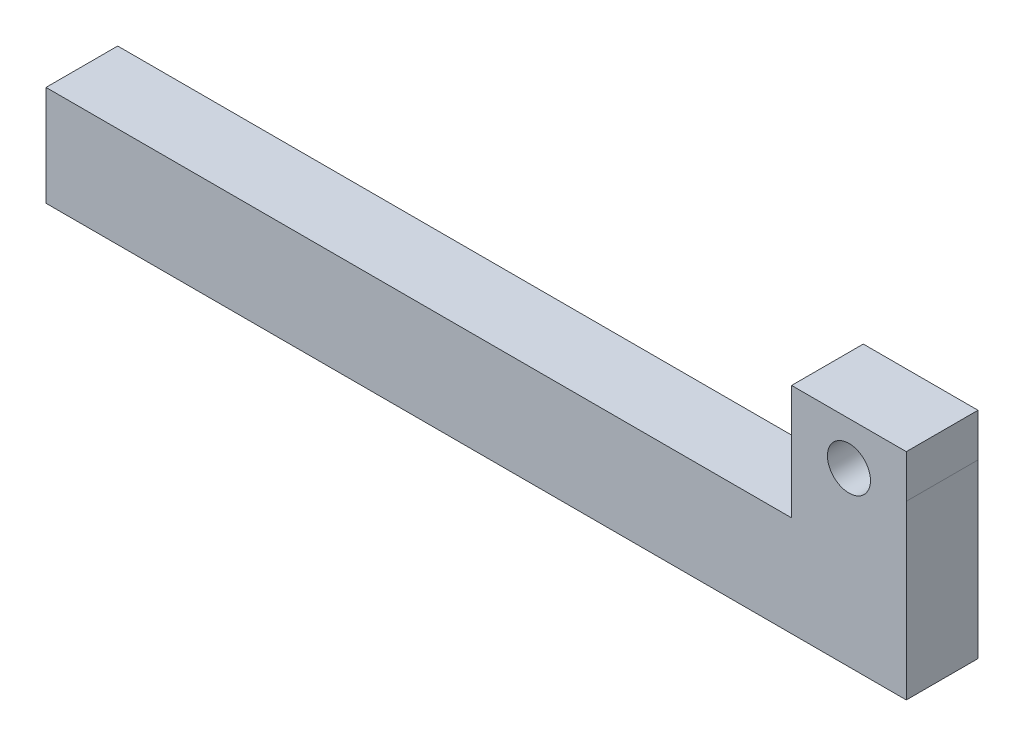
ISO-10303-21;
HEADER;
FILE_DESCRIPTION(('STEP AP214'),'2;1');
FILE_NAME('part.step','',(''),(''),'','','');
FILE_SCHEMA(('AUTOMOTIVE_DESIGN { 1 0 10303 214 1 1 1 1 }'));
ENDSEC;
DATA;
#1=APPLICATION_CONTEXT('core data for automotive mechanical design processes');
#2=APPLICATION_PROTOCOL_DEFINITION('international standard','automotive_design',2000,#1);
#3=PRODUCT_CONTEXT('',#1,'mechanical');
#4=PRODUCT('Part','Part','',(#3));
#5=PRODUCT_RELATED_PRODUCT_CATEGORY('part','',(#4));
#6=PRODUCT_DEFINITION_FORMATION('','',#4);
#7=PRODUCT_DEFINITION_CONTEXT('part definition',#1,'design');
#8=PRODUCT_DEFINITION('design','',#6,#7);
#9=PRODUCT_DEFINITION_SHAPE('','',#8);
#10=(LENGTH_UNIT() NAMED_UNIT(*) SI_UNIT(.MILLI.,.METRE.));
#11=(NAMED_UNIT(*) PLANE_ANGLE_UNIT() SI_UNIT($,.RADIAN.));
#12=(NAMED_UNIT(*) SI_UNIT($,.STERADIAN.) SOLID_ANGLE_UNIT());
#13=UNCERTAINTY_MEASURE_WITH_UNIT(LENGTH_MEASURE(1.E-05),#10,'distance_accuracy_value','');
#14=(GEOMETRIC_REPRESENTATION_CONTEXT(3) GLOBAL_UNCERTAINTY_ASSIGNED_CONTEXT((#13)) GLOBAL_UNIT_ASSIGNED_CONTEXT((#10,
#11,#12)) REPRESENTATION_CONTEXT('',''));
#15=CARTESIAN_POINT('',(0.,0.,0.));
#16=DIRECTION('',(0.,0.,1.));
#17=DIRECTION('',(1.,0.,0.));
#18=AXIS2_PLACEMENT_3D('',#15,#16,#17);
#19=CARTESIAN_POINT('',(300.,0.,25.));
#20=DIRECTION('',(-1.,0.,0.));
#21=DIRECTION('',(0.,0.,1.));
#22=AXIS2_PLACEMENT_3D('',#19,#20,#21);
#23=PLANE('',#22);
#24=DIRECTION('',(0.,0.,-1.));
#25=VECTOR('',#24,1.);
#26=CARTESIAN_POINT('',(300.,60.,25.));
#27=LINE('',#26,#25);
#28=CARTESIAN_POINT('',(300.,60.,25.));
#29=VERTEX_POINT('',#28);
#30=CARTESIAN_POINT('',(300.,60.,0.));
#31=VERTEX_POINT('',#30);
#32=EDGE_CURVE('E11',#29,#31,#27,.T.);
#33=ORIENTED_EDGE('',*,*,#32,.F.);
#34=DIRECTION('',(0.,1.,0.));
#35=VECTOR('',#34,1.);
#36=CARTESIAN_POINT('',(300.,0.,25.));
#37=LINE('',#36,#35);
#38=CARTESIAN_POINT('',(300.,0.,25.));
#39=VERTEX_POINT('',#38);
#40=EDGE_CURVE('E147',#39,#29,#37,.T.);
#41=ORIENTED_EDGE('',*,*,#40,.F.);
#42=DIRECTION('',(0.,0.,-1.));
#43=VECTOR('',#42,1.);
#44=CARTESIAN_POINT('',(300.,0.,25.));
#45=LINE('',#44,#43);
#46=CARTESIAN_POINT('',(300.,0.,0.));
#47=VERTEX_POINT('',#46);
#48=EDGE_CURVE('E99',#39,#47,#45,.T.);
#49=ORIENTED_EDGE('',*,*,#48,.T.);
#50=DIRECTION('',(0.,1.,0.));
#51=VECTOR('',#50,1.);
#52=CARTESIAN_POINT('',(300.,0.,0.));
#53=LINE('',#52,#51);
#54=EDGE_CURVE('E135',#47,#31,#53,.T.);
#55=ORIENTED_EDGE('',*,*,#54,.T.);
#56=EDGE_LOOP('',(#33,#41,#49,#55));
#57=FACE_BOUND('',#56,.T.);
#58=ADVANCED_FACE('F36',(#57),#23,.F.);
#59=CARTESIAN_POINT('',(0.,35.,25.));
#60=DIRECTION('',(0.,0.,1.));
#61=DIRECTION('',(1.,0.,0.));
#62=AXIS2_PLACEMENT_3D('',#59,#60,#61);
#63=PLANE('',#62);
#64=DIRECTION('',(0.,-1.,0.));
#65=VECTOR('',#64,1.);
#66=CARTESIAN_POINT('',(0.,0.,25.));
#67=LINE('',#66,#65);
#68=CARTESIAN_POINT('',(0.,35.,25.));
#69=VERTEX_POINT('',#68);
#70=CARTESIAN_POINT('',(0.,0.,25.));
#71=VERTEX_POINT('',#70);
#72=EDGE_CURVE('E103',#69,#71,#67,.T.);
#73=ORIENTED_EDGE('',*,*,#72,.T.);
#74=DIRECTION('',(1.,0.,0.));
#75=VECTOR('',#74,1.);
#76=CARTESIAN_POINT('',(0.,0.,25.));
#77=LINE('',#76,#75);
#78=EDGE_CURVE('E93',#71,#39,#77,.T.);
#79=ORIENTED_EDGE('',*,*,#78,.T.);
#80=ORIENTED_EDGE('',*,*,#40,.T.);
#81=CARTESIAN_POINT('',(300.,75.,25.));
#82=VERTEX_POINT('',#81);
#83=EDGE_CURVE('E102',#29,#82,#37,.T.);
#84=ORIENTED_EDGE('',*,*,#83,.T.);
#85=DIRECTION('',(-1.,0.,0.));
#86=VECTOR('',#85,1.);
#87=CARTESIAN_POINT('',(300.,75.,25.));
#88=LINE('',#87,#86);
#89=CARTESIAN_POINT('',(260.,75.,25.));
#90=VERTEX_POINT('',#89);
#91=EDGE_CURVE('E145',#82,#90,#88,.T.);
#92=ORIENTED_EDGE('',*,*,#91,.T.);
#93=DIRECTION('',(0.,-1.,0.));
#94=VECTOR('',#93,1.);
#95=CARTESIAN_POINT('',(260.,35.,25.));
#96=LINE('',#95,#94);
#97=CARTESIAN_POINT('',(260.,35.,25.));
#98=VERTEX_POINT('',#97);
#99=EDGE_CURVE('E143',#90,#98,#96,.T.);
#100=ORIENTED_EDGE('',*,*,#99,.T.);
#101=DIRECTION('',(-1.,0.,0.));
#102=VECTOR('',#101,1.);
#103=CARTESIAN_POINT('',(260.,35.,25.));
#104=LINE('',#103,#102);
#105=EDGE_CURVE('E109',#98,#69,#104,.T.);
#106=ORIENTED_EDGE('',*,*,#105,.T.);
#107=EDGE_LOOP('',(#73,#79,#80,#84,#92,#100,#106));
#108=FACE_BOUND('',#107,.T.);
#109=CARTESIAN_POINT('',(280.,60.,25.));
#110=DIRECTION('',(0.,0.,1.));
#111=DIRECTION('',(1.,0.,0.));
#112=AXIS2_PLACEMENT_3D('',#109,#110,#111);
#113=CIRCLE('',#112,7.50000000000001);
#114=CARTESIAN_POINT('',(287.5,60.,25.));
#115=VERTEX_POINT('',#114);
#116=EDGE_CURVE('E141',#115,#115,#113,.T.);
#117=ORIENTED_EDGE('',*,*,#116,.F.);
#118=EDGE_LOOP('',(#117));
#119=FACE_BOUND('',#118,.T.);
#120=ADVANCED_FACE('F106',(#108,#119),#63,.T.);
#121=CARTESIAN_POINT('',(0.,35.,0.));
#122=DIRECTION('',(0.,0.,1.));
#123=DIRECTION('',(1.,0.,0.));
#124=AXIS2_PLACEMENT_3D('',#121,#122,#123);
#125=PLANE('',#124);
#126=DIRECTION('',(0.,-1.,0.));
#127=VECTOR('',#126,1.);
#128=CARTESIAN_POINT('',(0.,0.,0.));
#129=LINE('',#128,#127);
#130=CARTESIAN_POINT('',(0.,35.,0.));
#131=VERTEX_POINT('',#130);
#132=CARTESIAN_POINT('',(0.,0.,0.));
#133=VERTEX_POINT('',#132);
#134=EDGE_CURVE('E116',#131,#133,#129,.T.);
#135=ORIENTED_EDGE('',*,*,#134,.F.);
#136=DIRECTION('',(-1.,0.,0.));
#137=VECTOR('',#136,1.);
#138=CARTESIAN_POINT('',(260.,35.,0.));
#139=LINE('',#138,#137);
#140=CARTESIAN_POINT('',(260.,35.,0.));
#141=VERTEX_POINT('',#140);
#142=EDGE_CURVE('E113',#141,#131,#139,.T.);
#143=ORIENTED_EDGE('',*,*,#142,.F.);
#144=DIRECTION('',(0.,-1.,0.));
#145=VECTOR('',#144,1.);
#146=CARTESIAN_POINT('',(260.,35.,0.));
#147=LINE('',#146,#145);
#148=CARTESIAN_POINT('',(260.,75.,0.));
#149=VERTEX_POINT('',#148);
#150=EDGE_CURVE('E131',#149,#141,#147,.T.);
#151=ORIENTED_EDGE('',*,*,#150,.F.);
#152=DIRECTION('',(-1.,0.,0.));
#153=VECTOR('',#152,1.);
#154=CARTESIAN_POINT('',(300.,75.,0.));
#155=LINE('',#154,#153);
#156=CARTESIAN_POINT('',(300.,75.,0.));
#157=VERTEX_POINT('',#156);
#158=EDGE_CURVE('E133',#157,#149,#155,.T.);
#159=ORIENTED_EDGE('',*,*,#158,.F.);
#160=EDGE_CURVE('E137',#31,#157,#53,.T.);
#161=ORIENTED_EDGE('',*,*,#160,.F.);
#162=ORIENTED_EDGE('',*,*,#54,.F.);
#163=DIRECTION('',(1.,0.,0.));
#164=VECTOR('',#163,1.);
#165=CARTESIAN_POINT('',(0.,0.,0.));
#166=LINE('',#165,#164);
#167=EDGE_CURVE('E138',#133,#47,#166,.T.);
#168=ORIENTED_EDGE('',*,*,#167,.F.);
#169=EDGE_LOOP('',(#135,#143,#151,#159,#161,#162,#168));
#170=FACE_BOUND('',#169,.T.);
#171=CARTESIAN_POINT('',(280.,60.,0.));
#172=DIRECTION('',(0.,0.,1.));
#173=DIRECTION('',(1.,0.,0.));
#174=AXIS2_PLACEMENT_3D('',#171,#172,#173);
#175=CIRCLE('',#174,7.50000000000001);
#176=CARTESIAN_POINT('',(287.5,60.,0.));
#177=VERTEX_POINT('',#176);
#178=EDGE_CURVE('E149',#177,#177,#175,.T.);
#179=ORIENTED_EDGE('',*,*,#178,.T.);
#180=EDGE_LOOP('',(#179));
#181=FACE_BOUND('',#180,.T.);
#182=ADVANCED_FACE('F158',(#170,#181),#125,.F.);
#183=CARTESIAN_POINT('',(0.,0.,25.));
#184=DIRECTION('',(1.,0.,0.));
#185=DIRECTION('',(0.,0.,-1.));
#186=AXIS2_PLACEMENT_3D('',#183,#184,#185);
#187=PLANE('',#186);
#188=ORIENTED_EDGE('',*,*,#134,.T.);
#189=DIRECTION('',(0.,0.,-1.));
#190=VECTOR('',#189,1.);
#191=CARTESIAN_POINT('',(0.,0.,25.));
#192=LINE('',#191,#190);
#193=EDGE_CURVE('E45',#71,#133,#192,.T.);
#194=ORIENTED_EDGE('',*,*,#193,.F.);
#195=ORIENTED_EDGE('',*,*,#72,.F.);
#196=DIRECTION('',(0.,0.,-1.));
#197=VECTOR('',#196,1.);
#198=CARTESIAN_POINT('',(0.,35.,25.));
#199=LINE('',#198,#197);
#200=EDGE_CURVE('E128',#69,#131,#199,.T.);
#201=ORIENTED_EDGE('',*,*,#200,.T.);
#202=EDGE_LOOP('',(#188,#194,#195,#201));
#203=FACE_BOUND('',#202,.T.);
#204=ADVANCED_FACE('F38',(#203),#187,.F.);
#205=CARTESIAN_POINT('',(0.,0.,25.));
#206=DIRECTION('',(0.,1.,0.));
#207=DIRECTION('',(0.,0.,1.));
#208=AXIS2_PLACEMENT_3D('',#205,#206,#207);
#209=PLANE('',#208);
#210=ORIENTED_EDGE('',*,*,#167,.T.);
#211=ORIENTED_EDGE('',*,*,#48,.F.);
#212=ORIENTED_EDGE('',*,*,#78,.F.);
#213=ORIENTED_EDGE('',*,*,#193,.T.);
#214=EDGE_LOOP('',(#210,#211,#212,#213));
#215=FACE_BOUND('',#214,.T.);
#216=ADVANCED_FACE('F95',(#215),#209,.F.);
#217=ORIENTED_EDGE('',*,*,#83,.F.);
#218=ORIENTED_EDGE('',*,*,#32,.T.);
#219=ORIENTED_EDGE('',*,*,#160,.T.);
#220=DIRECTION('',(0.,0.,-1.));
#221=VECTOR('',#220,1.);
#222=CARTESIAN_POINT('',(300.,75.,25.));
#223=LINE('',#222,#221);
#224=EDGE_CURVE('E117',#82,#157,#223,.T.);
#225=ORIENTED_EDGE('',*,*,#224,.F.);
#226=EDGE_LOOP('',(#217,#218,#219,#225));
#227=FACE_BOUND('',#226,.T.);
#228=ADVANCED_FACE('F167',(#227),#23,.F.);
#229=CARTESIAN_POINT('',(300.,75.,25.));
#230=DIRECTION('',(0.,-1.,0.));
#231=DIRECTION('',(0.,0.,-1.));
#232=AXIS2_PLACEMENT_3D('',#229,#230,#231);
#233=PLANE('',#232);
#234=ORIENTED_EDGE('',*,*,#158,.T.);
#235=DIRECTION('',(0.,0.,-1.));
#236=VECTOR('',#235,1.);
#237=CARTESIAN_POINT('',(260.,75.,25.));
#238=LINE('',#237,#236);
#239=EDGE_CURVE('E122',#90,#149,#238,.T.);
#240=ORIENTED_EDGE('',*,*,#239,.F.);
#241=ORIENTED_EDGE('',*,*,#91,.F.);
#242=ORIENTED_EDGE('',*,*,#224,.T.);
#243=EDGE_LOOP('',(#234,#240,#241,#242));
#244=FACE_BOUND('',#243,.T.);
#245=ADVANCED_FACE('F177',(#244),#233,.F.);
#246=CARTESIAN_POINT('',(260.,35.,25.));
#247=DIRECTION('',(1.,0.,0.));
#248=DIRECTION('',(0.,0.,-1.));
#249=AXIS2_PLACEMENT_3D('',#246,#247,#248);
#250=PLANE('',#249);
#251=ORIENTED_EDGE('',*,*,#150,.T.);
#252=DIRECTION('',(0.,0.,-1.));
#253=VECTOR('',#252,1.);
#254=CARTESIAN_POINT('',(260.,35.,25.));
#255=LINE('',#254,#253);
#256=EDGE_CURVE('E125',#98,#141,#255,.T.);
#257=ORIENTED_EDGE('',*,*,#256,.F.);
#258=ORIENTED_EDGE('',*,*,#99,.F.);
#259=ORIENTED_EDGE('',*,*,#239,.T.);
#260=EDGE_LOOP('',(#251,#257,#258,#259));
#261=FACE_BOUND('',#260,.T.);
#262=ADVANCED_FACE('F173',(#261),#250,.F.);
#263=CARTESIAN_POINT('',(260.,35.,25.));
#264=DIRECTION('',(0.,-1.,0.));
#265=DIRECTION('',(1.,0.,0.));
#266=AXIS2_PLACEMENT_3D('',#263,#264,#265);
#267=PLANE('',#266);
#268=ORIENTED_EDGE('',*,*,#142,.T.);
#269=ORIENTED_EDGE('',*,*,#200,.F.);
#270=ORIENTED_EDGE('',*,*,#105,.F.);
#271=ORIENTED_EDGE('',*,*,#256,.T.);
#272=EDGE_LOOP('',(#268,#269,#270,#271));
#273=FACE_BOUND('',#272,.T.);
#274=ADVANCED_FACE('F170',(#273),#267,.F.);
#275=CARTESIAN_POINT('',(280.,60.,25.));
#276=DIRECTION('',(0.,0.,-1.));
#277=DIRECTION('',(-1.,0.,0.));
#278=AXIS2_PLACEMENT_3D('',#275,#276,#277);
#279=CYLINDRICAL_SURFACE('',#278,7.50000000000001);
#280=ORIENTED_EDGE('',*,*,#116,.T.);
#281=EDGE_LOOP('',(#280));
#282=FACE_BOUND('',#281,.T.);
#283=ORIENTED_EDGE('',*,*,#178,.F.);
#284=EDGE_LOOP('',(#283));
#285=FACE_BOUND('',#284,.T.);
#286=ADVANCED_FACE('F155',(#282,#285),#279,.F.);
#287=CLOSED_SHELL('',(#58,#120,#182,#204,#216,#228,#245,#262,#274,#286));
#288=MANIFOLD_SOLID_BREP('B2',#287);
#289=ADVANCED_BREP_SHAPE_REPRESENTATION('',(#18,#288),#14);
#290=SHAPE_DEFINITION_REPRESENTATION(#9,#289);
ENDSEC;
END-ISO-10303-21;
